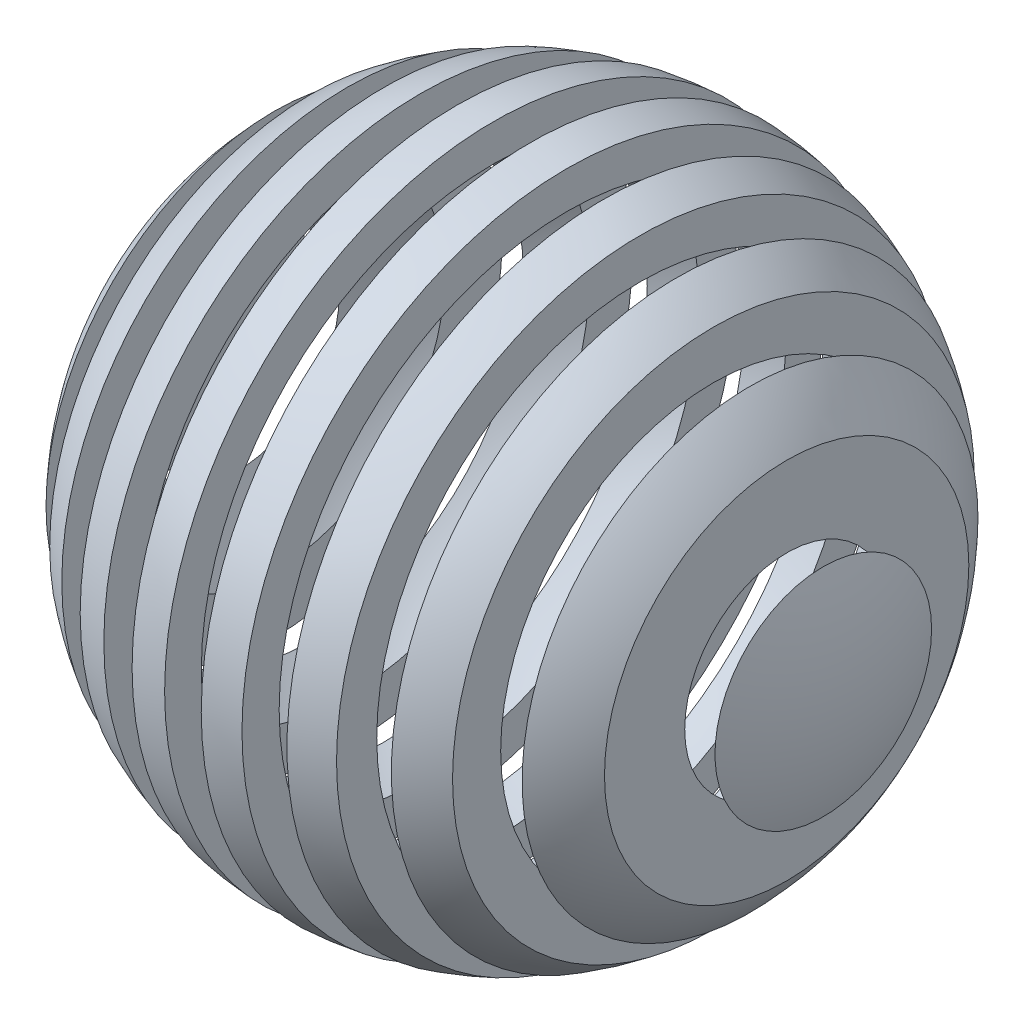
ISO-10303-21;
HEADER;
FILE_DESCRIPTION(('STEP AP214'),'2;1');
FILE_NAME('part.step','',(''),(''),'','','');
FILE_SCHEMA(('AUTOMOTIVE_DESIGN { 1 0 10303 214 1 1 1 1 }'));
ENDSEC;
DATA;
#1=APPLICATION_CONTEXT('core data for automotive mechanical design processes');
#2=APPLICATION_PROTOCOL_DEFINITION('international standard','automotive_design',2000,#1);
#3=PRODUCT_CONTEXT('',#1,'mechanical');
#4=PRODUCT('Part','Part','',(#3));
#5=PRODUCT_RELATED_PRODUCT_CATEGORY('part','',(#4));
#6=PRODUCT_DEFINITION_FORMATION('','',#4);
#7=PRODUCT_DEFINITION_CONTEXT('part definition',#1,'design');
#8=PRODUCT_DEFINITION('design','',#6,#7);
#9=PRODUCT_DEFINITION_SHAPE('','',#8);
#10=(LENGTH_UNIT() NAMED_UNIT(*) SI_UNIT(.MILLI.,.METRE.));
#11=(NAMED_UNIT(*) PLANE_ANGLE_UNIT() SI_UNIT($,.RADIAN.));
#12=(NAMED_UNIT(*) SI_UNIT($,.STERADIAN.) SOLID_ANGLE_UNIT());
#13=UNCERTAINTY_MEASURE_WITH_UNIT(LENGTH_MEASURE(1.E-05),#10,'distance_accuracy_value','');
#14=(GEOMETRIC_REPRESENTATION_CONTEXT(3) GLOBAL_UNCERTAINTY_ASSIGNED_CONTEXT((#13)) GLOBAL_UNIT_ASSIGNED_CONTEXT((#10,
#11,#12)) REPRESENTATION_CONTEXT('',''));
#15=CARTESIAN_POINT('',(0.,0.,0.));
#16=DIRECTION('',(0.,0.,1.));
#17=DIRECTION('',(1.,0.,0.));
#18=AXIS2_PLACEMENT_3D('',#15,#16,#17);
#19=CARTESIAN_POINT('',(0.,0.,0.));
#20=DIRECTION('',(-1.,0.,0.));
#21=DIRECTION('',(0.,1.,0.));
#22=AXIS2_PLACEMENT_3D('',#19,#20,#21);
#23=SPHERICAL_SURFACE('',#22,450.);
#24=CARTESIAN_POINT('',(-375.,0.,0.));
#25=DIRECTION('',(1.,0.,0.));
#26=DIRECTION('',(0.,0.,-1.));
#27=AXIS2_PLACEMENT_3D('',#24,#25,#26);
#28=CIRCLE('',#27,248.746859276655);
#29=CARTESIAN_POINT('',(-375.,0.,-248.746859276655));
#30=VERTEX_POINT('',#29);
#31=EDGE_CURVE('E56',#30,#30,#28,.T.);
#32=ORIENTED_EDGE('',*,*,#31,.T.);
#33=EDGE_LOOP('',(#32));
#34=FACE_BOUND('',#33,.T.);
#35=CARTESIAN_POINT('',(-325.,0.,0.));
#36=DIRECTION('',(-1.,0.,0.));
#37=DIRECTION('',(0.,0.,1.));
#38=AXIS2_PLACEMENT_3D('',#35,#36,#37);
#39=CIRCLE('',#38,311.247489949718);
#40=CARTESIAN_POINT('',(-325.,0.,311.247489949718));
#41=VERTEX_POINT('',#40);
#42=EDGE_CURVE('E64',#41,#41,#39,.T.);
#43=ORIENTED_EDGE('',*,*,#42,.T.);
#44=EDGE_LOOP('',(#43));
#45=FACE_BOUND('',#44,.T.);
#46=ADVANCED_FACE('F53',(#34,#45),#23,.T.);
#47=CARTESIAN_POINT('',(-325.,-488.145150409962,-449.305018890286));
#48=DIRECTION('',(-1.,0.,0.));
#49=DIRECTION('',(0.,0.,1.));
#50=AXIS2_PLACEMENT_3D('',#47,#48,#49);
#51=PLANE('',#50);
#52=ORIENTED_EDGE('',*,*,#42,.F.);
#53=EDGE_LOOP('',(#52));
#54=FACE_BOUND('',#53,.T.);
#55=CARTESIAN_POINT('',(-325.,0.,0.));
#56=DIRECTION('',(-1.,0.,0.));
#57=DIRECTION('',(0.,0.,1.));
#58=AXIS2_PLACEMENT_3D('',#55,#56,#57);
#59=CIRCLE('',#58,233.18447632722);
#60=CARTESIAN_POINT('',(-325.,0.,233.18447632722));
#61=VERTEX_POINT('',#60);
#62=EDGE_CURVE('E11',#61,#61,#59,.F.);
#63=ORIENTED_EDGE('',*,*,#62,.F.);
#64=EDGE_LOOP('',(#63));
#65=FACE_BOUND('',#64,.T.);
#66=ADVANCED_FACE('F81',(#54,#65),#51,.F.);
#67=CARTESIAN_POINT('',(0.,0.,0.));
#68=DIRECTION('',(-1.,0.,0.));
#69=DIRECTION('',(0.,1.,0.));
#70=AXIS2_PLACEMENT_3D('',#67,#68,#69);
#71=SPHERICAL_SURFACE('',#70,400.);
#72=CARTESIAN_POINT('',(-375.,0.,0.));
#73=DIRECTION('',(1.,0.,0.));
#74=DIRECTION('',(0.,0.,-1.));
#75=AXIS2_PLACEMENT_3D('',#72,#73,#74);
#76=CIRCLE('',#75,139.194109070751);
#77=CARTESIAN_POINT('',(-375.,0.,-139.194109070751));
#78=VERTEX_POINT('',#77);
#79=EDGE_CURVE('E60',#78,#78,#76,.F.);
#80=ORIENTED_EDGE('',*,*,#79,.T.);
#81=EDGE_LOOP('',(#80));
#82=FACE_BOUND('',#81,.T.);
#83=ORIENTED_EDGE('',*,*,#62,.T.);
#84=EDGE_LOOP('',(#83));
#85=FACE_BOUND('',#84,.T.);
#86=ADVANCED_FACE('F76',(#82,#85),#71,.F.);
#87=CARTESIAN_POINT('',(-375.,-488.145150409962,-449.305018890286));
#88=DIRECTION('',(1.,0.,0.));
#89=DIRECTION('',(0.,0.,-1.));
#90=AXIS2_PLACEMENT_3D('',#87,#88,#89);
#91=PLANE('',#90);
#92=ORIENTED_EDGE('',*,*,#79,.F.);
#93=EDGE_LOOP('',(#92));
#94=FACE_BOUND('',#93,.T.);
#95=ORIENTED_EDGE('',*,*,#31,.F.);
#96=EDGE_LOOP('',(#95));
#97=FACE_BOUND('',#96,.T.);
#98=ADVANCED_FACE('F74',(#94,#97),#91,.F.);
#99=CLOSED_SHELL('',(#46,#66,#86,#98));
#100=MANIFOLD_SOLID_BREP('B2',#99);
#101=CARTESIAN_POINT('',(0.,0.,0.));
#102=DIRECTION('',(-1.,0.,0.));
#103=DIRECTION('',(0.,1.,0.));
#104=AXIS2_PLACEMENT_3D('',#101,#102,#103);
#105=SPHERICAL_SURFACE('',#104,400.);
#106=CARTESIAN_POINT('',(-275.,0.,0.));
#107=DIRECTION('',(1.,0.,0.));
#108=DIRECTION('',(0.,0.,-1.));
#109=AXIS2_PLACEMENT_3D('',#106,#107,#108);
#110=CIRCLE('',#109,290.473750965556);
#111=CARTESIAN_POINT('',(-275.,0.,-290.473750965556));
#112=VERTEX_POINT('',#111);
#113=EDGE_CURVE('E125',#112,#112,#110,.F.);
#114=ORIENTED_EDGE('',*,*,#113,.T.);
#115=EDGE_LOOP('',(#114));
#116=FACE_BOUND('',#115,.T.);
#117=CARTESIAN_POINT('',(-225.,0.,0.));
#118=DIRECTION('',(-1.,0.,0.));
#119=DIRECTION('',(0.,0.,1.));
#120=AXIS2_PLACEMENT_3D('',#117,#118,#119);
#121=CIRCLE('',#120,330.718913883074);
#122=CARTESIAN_POINT('',(-225.,0.,330.718913883074));
#123=VERTEX_POINT('',#122);
#124=EDGE_CURVE('E135',#123,#123,#121,.F.);
#125=ORIENTED_EDGE('',*,*,#124,.T.);
#126=EDGE_LOOP('',(#125));
#127=FACE_BOUND('',#126,.T.);
#128=ADVANCED_FACE('F122',(#116,#127),#105,.F.);
#129=CARTESIAN_POINT('',(0.,0.,0.));
#130=DIRECTION('',(-1.,0.,0.));
#131=DIRECTION('',(0.,1.,0.));
#132=AXIS2_PLACEMENT_3D('',#129,#130,#131);
#133=SPHERICAL_SURFACE('',#132,450.);
#134=CARTESIAN_POINT('',(-275.,0.,0.));
#135=DIRECTION('',(1.,0.,0.));
#136=DIRECTION('',(0.,0.,-1.));
#137=AXIS2_PLACEMENT_3D('',#134,#135,#136);
#138=CIRCLE('',#137,356.195171219375);
#139=CARTESIAN_POINT('',(-275.,0.,-356.195171219375));
#140=VERTEX_POINT('',#139);
#141=EDGE_CURVE('E130',#140,#140,#138,.T.);
#142=ORIENTED_EDGE('',*,*,#141,.T.);
#143=EDGE_LOOP('',(#142));
#144=FACE_BOUND('',#143,.T.);
#145=CARTESIAN_POINT('',(-225.,0.,0.));
#146=DIRECTION('',(-1.,0.,0.));
#147=DIRECTION('',(0.,0.,1.));
#148=AXIS2_PLACEMENT_3D('',#145,#146,#147);
#149=CIRCLE('',#148,389.711431702997);
#150=CARTESIAN_POINT('',(-225.,0.,389.711431702997));
#151=VERTEX_POINT('',#150);
#152=EDGE_CURVE('E52',#151,#151,#149,.T.);
#153=ORIENTED_EDGE('',*,*,#152,.T.);
#154=EDGE_LOOP('',(#153));
#155=FACE_BOUND('',#154,.T.);
#156=ADVANCED_FACE('F155',(#144,#155),#133,.T.);
#157=CARTESIAN_POINT('',(-225.,-488.145150409962,-449.305018890286));
#158=DIRECTION('',(-1.,0.,0.));
#159=DIRECTION('',(0.,0.,1.));
#160=AXIS2_PLACEMENT_3D('',#157,#158,#159);
#161=PLANE('',#160);
#162=ORIENTED_EDGE('',*,*,#124,.F.);
#163=EDGE_LOOP('',(#162));
#164=FACE_BOUND('',#163,.T.);
#165=ORIENTED_EDGE('',*,*,#152,.F.);
#166=EDGE_LOOP('',(#165));
#167=FACE_BOUND('',#166,.T.);
#168=ADVANCED_FACE('F149',(#164,#167),#161,.F.);
#169=CARTESIAN_POINT('',(-275.,-488.145150409962,-449.305018890286));
#170=DIRECTION('',(1.,0.,0.));
#171=DIRECTION('',(0.,0.,-1.));
#172=AXIS2_PLACEMENT_3D('',#169,#170,#171);
#173=PLANE('',#172);
#174=ORIENTED_EDGE('',*,*,#141,.F.);
#175=EDGE_LOOP('',(#174));
#176=FACE_BOUND('',#175,.T.);
#177=ORIENTED_EDGE('',*,*,#113,.F.);
#178=EDGE_LOOP('',(#177));
#179=FACE_BOUND('',#178,.T.);
#180=ADVANCED_FACE('F147',(#176,#179),#173,.F.);
#181=CLOSED_SHELL('',(#128,#156,#168,#180));
#182=MANIFOLD_SOLID_BREP('B6',#181);
#183=CARTESIAN_POINT('',(0.,0.,0.));
#184=DIRECTION('',(-1.,0.,0.));
#185=DIRECTION('',(0.,1.,0.));
#186=AXIS2_PLACEMENT_3D('',#183,#184,#185);
#187=SPHERICAL_SURFACE('',#186,450.);
#188=CARTESIAN_POINT('',(-175.,0.,0.));
#189=DIRECTION('',(1.,0.,0.));
#190=DIRECTION('',(0.,0.,-1.));
#191=AXIS2_PLACEMENT_3D('',#188,#189,#190);
#192=CIRCLE('',#191,414.578098794425);
#193=CARTESIAN_POINT('',(-175.,0.,-414.578098794425));
#194=VERTEX_POINT('',#193);
#195=EDGE_CURVE('E198',#194,#194,#192,.T.);
#196=ORIENTED_EDGE('',*,*,#195,.T.);
#197=EDGE_LOOP('',(#196));
#198=FACE_BOUND('',#197,.T.);
#199=CARTESIAN_POINT('',(-125.,0.,0.));
#200=DIRECTION('',(-1.,0.,0.));
#201=DIRECTION('',(0.,0.,1.));
#202=AXIS2_PLACEMENT_3D('',#199,#200,#201);
#203=CIRCLE('',#202,432.290411644765);
#204=CARTESIAN_POINT('',(-125.,0.,432.290411644765));
#205=VERTEX_POINT('',#204);
#206=EDGE_CURVE('E206',#205,#205,#203,.T.);
#207=ORIENTED_EDGE('',*,*,#206,.T.);
#208=EDGE_LOOP('',(#207));
#209=FACE_BOUND('',#208,.T.);
#210=ADVANCED_FACE('F195',(#198,#209),#187,.T.);
#211=CARTESIAN_POINT('',(0.,0.,0.));
#212=DIRECTION('',(-1.,0.,0.));
#213=DIRECTION('',(0.,1.,0.));
#214=AXIS2_PLACEMENT_3D('',#211,#212,#213);
#215=SPHERICAL_SURFACE('',#214,400.);
#216=CARTESIAN_POINT('',(-175.,0.,0.));
#217=DIRECTION('',(1.,0.,0.));
#218=DIRECTION('',(0.,0.,-1.));
#219=AXIS2_PLACEMENT_3D('',#216,#217,#218);
#220=CIRCLE('',#219,359.687364248454);
#221=CARTESIAN_POINT('',(-175.,0.,-359.687364248454));
#222=VERTEX_POINT('',#221);
#223=EDGE_CURVE('E202',#222,#222,#220,.F.);
#224=ORIENTED_EDGE('',*,*,#223,.T.);
#225=EDGE_LOOP('',(#224));
#226=FACE_BOUND('',#225,.T.);
#227=CARTESIAN_POINT('',(-125.,0.,0.));
#228=DIRECTION('',(-1.,0.,0.));
#229=DIRECTION('',(0.,0.,1.));
#230=AXIS2_PLACEMENT_3D('',#227,#228,#229);
#231=CIRCLE('',#230,379.967103839267);
#232=CARTESIAN_POINT('',(-125.,0.,379.967103839267));
#233=VERTEX_POINT('',#232);
#234=EDGE_CURVE('E121',#233,#233,#231,.F.);
#235=ORIENTED_EDGE('',*,*,#234,.T.);
#236=EDGE_LOOP('',(#235));
#237=FACE_BOUND('',#236,.T.);
#238=ADVANCED_FACE('F224',(#226,#237),#215,.F.);
#239=CARTESIAN_POINT('',(-125.,-488.145150409962,-449.305018890286));
#240=DIRECTION('',(-1.,0.,0.));
#241=DIRECTION('',(0.,0.,1.));
#242=AXIS2_PLACEMENT_3D('',#239,#240,#241);
#243=PLANE('',#242);
#244=ORIENTED_EDGE('',*,*,#206,.F.);
#245=EDGE_LOOP('',(#244));
#246=FACE_BOUND('',#245,.T.);
#247=ORIENTED_EDGE('',*,*,#234,.F.);
#248=EDGE_LOOP('',(#247));
#249=FACE_BOUND('',#248,.T.);
#250=ADVANCED_FACE('F218',(#246,#249),#243,.F.);
#251=CARTESIAN_POINT('',(-175.,-488.145150409962,-449.305018890286));
#252=DIRECTION('',(1.,0.,0.));
#253=DIRECTION('',(0.,0.,-1.));
#254=AXIS2_PLACEMENT_3D('',#251,#252,#253);
#255=PLANE('',#254);
#256=ORIENTED_EDGE('',*,*,#223,.F.);
#257=EDGE_LOOP('',(#256));
#258=FACE_BOUND('',#257,.T.);
#259=ORIENTED_EDGE('',*,*,#195,.F.);
#260=EDGE_LOOP('',(#259));
#261=FACE_BOUND('',#260,.T.);
#262=ADVANCED_FACE('F216',(#258,#261),#255,.F.);
#263=CLOSED_SHELL('',(#210,#238,#250,#262));
#264=MANIFOLD_SOLID_BREP('B47',#263);
#265=CARTESIAN_POINT('',(0.,0.,0.));
#266=DIRECTION('',(-1.,0.,0.));
#267=DIRECTION('',(0.,1.,0.));
#268=AXIS2_PLACEMENT_3D('',#265,#266,#267);
#269=SPHERICAL_SURFACE('',#268,400.);
#270=CARTESIAN_POINT('',(-75.,0.,0.));
#271=DIRECTION('',(1.,0.,0.));
#272=DIRECTION('',(0.,0.,-1.));
#273=AXIS2_PLACEMENT_3D('',#270,#271,#272);
#274=CIRCLE('',#273,392.905841137543);
#275=CARTESIAN_POINT('',(-75.,0.,-392.905841137543));
#276=VERTEX_POINT('',#275);
#277=EDGE_CURVE('E267',#276,#276,#274,.F.);
#278=ORIENTED_EDGE('',*,*,#277,.T.);
#279=EDGE_LOOP('',(#278));
#280=FACE_BOUND('',#279,.T.);
#281=CARTESIAN_POINT('',(-25.,0.,0.));
#282=DIRECTION('',(-1.,0.,0.));
#283=DIRECTION('',(0.,0.,1.));
#284=AXIS2_PLACEMENT_3D('',#281,#282,#283);
#285=CIRCLE('',#284,399.217985566783);
#286=CARTESIAN_POINT('',(-25.,0.,399.217985566783));
#287=VERTEX_POINT('',#286);
#288=EDGE_CURVE('E275',#287,#287,#285,.F.);
#289=ORIENTED_EDGE('',*,*,#288,.T.);
#290=EDGE_LOOP('',(#289));
#291=FACE_BOUND('',#290,.T.);
#292=ADVANCED_FACE('F264',(#280,#291),#269,.F.);
#293=CARTESIAN_POINT('',(0.,0.,0.));
#294=DIRECTION('',(-1.,0.,0.));
#295=DIRECTION('',(0.,1.,0.));
#296=AXIS2_PLACEMENT_3D('',#293,#294,#295);
#297=SPHERICAL_SURFACE('',#296,450.);
#298=CARTESIAN_POINT('',(-75.,0.,0.));
#299=DIRECTION('',(1.,0.,0.));
#300=DIRECTION('',(0.,0.,-1.));
#301=AXIS2_PLACEMENT_3D('',#298,#299,#300);
#302=CIRCLE('',#301,443.705983732471);
#303=CARTESIAN_POINT('',(-75.,0.,-443.705983732471));
#304=VERTEX_POINT('',#303);
#305=EDGE_CURVE('E271',#304,#304,#302,.T.);
#306=ORIENTED_EDGE('',*,*,#305,.T.);
#307=EDGE_LOOP('',(#306));
#308=FACE_BOUND('',#307,.T.);
#309=CARTESIAN_POINT('',(-25.,0.,0.));
#310=DIRECTION('',(-1.,0.,0.));
#311=DIRECTION('',(0.,0.,1.));
#312=AXIS2_PLACEMENT_3D('',#309,#310,#311);
#313=CIRCLE('',#312,449.305018890286);
#314=CARTESIAN_POINT('',(-25.,0.,449.305018890286));
#315=VERTEX_POINT('',#314);
#316=EDGE_CURVE('E194',#315,#315,#313,.T.);
#317=ORIENTED_EDGE('',*,*,#316,.T.);
#318=EDGE_LOOP('',(#317));
#319=FACE_BOUND('',#318,.T.);
#320=ADVANCED_FACE('F293',(#308,#319),#297,.T.);
#321=CARTESIAN_POINT('',(-25.,-488.145150409962,-450.));
#322=DIRECTION('',(-1.,0.,0.));
#323=DIRECTION('',(0.,0.,1.));
#324=AXIS2_PLACEMENT_3D('',#321,#322,#323);
#325=PLANE('',#324);
#326=ORIENTED_EDGE('',*,*,#288,.F.);
#327=EDGE_LOOP('',(#326));
#328=FACE_BOUND('',#327,.T.);
#329=ORIENTED_EDGE('',*,*,#316,.F.);
#330=EDGE_LOOP('',(#329));
#331=FACE_BOUND('',#330,.T.);
#332=ADVANCED_FACE('F287',(#328,#331),#325,.F.);
#333=CARTESIAN_POINT('',(-75.,-488.145150409962,-449.305018890286));
#334=DIRECTION('',(1.,0.,0.));
#335=DIRECTION('',(0.,0.,-1.));
#336=AXIS2_PLACEMENT_3D('',#333,#334,#335);
#337=PLANE('',#336);
#338=ORIENTED_EDGE('',*,*,#305,.F.);
#339=EDGE_LOOP('',(#338));
#340=FACE_BOUND('',#339,.T.);
#341=ORIENTED_EDGE('',*,*,#277,.F.);
#342=EDGE_LOOP('',(#341));
#343=FACE_BOUND('',#342,.T.);
#344=ADVANCED_FACE('F285',(#340,#343),#337,.F.);
#345=CLOSED_SHELL('',(#292,#320,#332,#344));
#346=MANIFOLD_SOLID_BREP('B116',#345);
#347=CARTESIAN_POINT('',(0.,0.,0.));
#348=DIRECTION('',(-1.,0.,0.));
#349=DIRECTION('',(0.,1.,0.));
#350=AXIS2_PLACEMENT_3D('',#347,#348,#349);
#351=SPHERICAL_SURFACE('',#350,450.);
#352=CARTESIAN_POINT('',(375.,0.,0.));
#353=DIRECTION('',(-1.,0.,0.));
#354=DIRECTION('',(0.,0.,1.));
#355=AXIS2_PLACEMENT_3D('',#352,#353,#354);
#356=CIRCLE('',#355,248.746859276655);
#357=CARTESIAN_POINT('',(375.,0.,248.746859276655));
#358=VERTEX_POINT('',#357);
#359=EDGE_CURVE('E336',#358,#358,#356,.T.);
#360=ORIENTED_EDGE('',*,*,#359,.T.);
#361=EDGE_LOOP('',(#360));
#362=FACE_BOUND('',#361,.T.);
#363=CARTESIAN_POINT('',(325.,0.,0.));
#364=DIRECTION('',(1.,0.,0.));
#365=DIRECTION('',(0.,0.,-1.));
#366=AXIS2_PLACEMENT_3D('',#363,#364,#365);
#367=CIRCLE('',#366,311.247489949718);
#368=CARTESIAN_POINT('',(325.,0.,-311.247489949718));
#369=VERTEX_POINT('',#368);
#370=EDGE_CURVE('E344',#369,#369,#367,.T.);
#371=ORIENTED_EDGE('',*,*,#370,.T.);
#372=EDGE_LOOP('',(#371));
#373=FACE_BOUND('',#372,.T.);
#374=ADVANCED_FACE('F333',(#362,#373),#351,.T.);
#375=CARTESIAN_POINT('',(325.,-488.145150409962,-449.305018890286));
#376=DIRECTION('',(1.,0.,0.));
#377=DIRECTION('',(0.,0.,-1.));
#378=AXIS2_PLACEMENT_3D('',#375,#376,#377);
#379=PLANE('',#378);
#380=ORIENTED_EDGE('',*,*,#370,.F.);
#381=EDGE_LOOP('',(#380));
#382=FACE_BOUND('',#381,.T.);
#383=CARTESIAN_POINT('',(325.,0.,0.));
#384=DIRECTION('',(1.,0.,0.));
#385=DIRECTION('',(0.,0.,-1.));
#386=AXIS2_PLACEMENT_3D('',#383,#384,#385);
#387=CIRCLE('',#386,233.18447632722);
#388=CARTESIAN_POINT('',(325.,0.,-233.18447632722));
#389=VERTEX_POINT('',#388);
#390=EDGE_CURVE('E263',#389,#389,#387,.F.);
#391=ORIENTED_EDGE('',*,*,#390,.F.);
#392=EDGE_LOOP('',(#391));
#393=FACE_BOUND('',#392,.T.);
#394=ADVANCED_FACE('F361',(#382,#393),#379,.F.);
#395=CARTESIAN_POINT('',(0.,0.,0.));
#396=DIRECTION('',(-1.,0.,0.));
#397=DIRECTION('',(0.,1.,0.));
#398=AXIS2_PLACEMENT_3D('',#395,#396,#397);
#399=SPHERICAL_SURFACE('',#398,400.);
#400=CARTESIAN_POINT('',(375.,0.,0.));
#401=DIRECTION('',(-1.,0.,0.));
#402=DIRECTION('',(0.,0.,1.));
#403=AXIS2_PLACEMENT_3D('',#400,#401,#402);
#404=CIRCLE('',#403,139.194109070751);
#405=CARTESIAN_POINT('',(375.,0.,139.194109070751));
#406=VERTEX_POINT('',#405);
#407=EDGE_CURVE('E340',#406,#406,#404,.F.);
#408=ORIENTED_EDGE('',*,*,#407,.T.);
#409=EDGE_LOOP('',(#408));
#410=FACE_BOUND('',#409,.T.);
#411=ORIENTED_EDGE('',*,*,#390,.T.);
#412=EDGE_LOOP('',(#411));
#413=FACE_BOUND('',#412,.T.);
#414=ADVANCED_FACE('F356',(#410,#413),#399,.F.);
#415=CARTESIAN_POINT('',(375.,-488.145150409962,-449.305018890286));
#416=DIRECTION('',(-1.,0.,0.));
#417=DIRECTION('',(0.,0.,1.));
#418=AXIS2_PLACEMENT_3D('',#415,#416,#417);
#419=PLANE('',#418);
#420=ORIENTED_EDGE('',*,*,#407,.F.);
#421=EDGE_LOOP('',(#420));
#422=FACE_BOUND('',#421,.T.);
#423=ORIENTED_EDGE('',*,*,#359,.F.);
#424=EDGE_LOOP('',(#423));
#425=FACE_BOUND('',#424,.T.);
#426=ADVANCED_FACE('F354',(#422,#425),#419,.F.);
#427=CLOSED_SHELL('',(#374,#394,#414,#426));
#428=MANIFOLD_SOLID_BREP('B189',#427);
#429=CARTESIAN_POINT('',(0.,0.,0.));
#430=DIRECTION('',(-1.,0.,0.));
#431=DIRECTION('',(0.,1.,0.));
#432=AXIS2_PLACEMENT_3D('',#429,#430,#431);
#433=SPHERICAL_SURFACE('',#432,400.);
#434=CARTESIAN_POINT('',(275.,0.,0.));
#435=DIRECTION('',(-1.,0.,0.));
#436=DIRECTION('',(0.,0.,1.));
#437=AXIS2_PLACEMENT_3D('',#434,#435,#436);
#438=CIRCLE('',#437,290.473750965556);
#439=CARTESIAN_POINT('',(275.,0.,290.473750965556));
#440=VERTEX_POINT('',#439);
#441=EDGE_CURVE('E405',#440,#440,#438,.F.);
#442=ORIENTED_EDGE('',*,*,#441,.T.);
#443=EDGE_LOOP('',(#442));
#444=FACE_BOUND('',#443,.T.);
#445=CARTESIAN_POINT('',(225.,0.,0.));
#446=DIRECTION('',(1.,0.,0.));
#447=DIRECTION('',(0.,0.,-1.));
#448=AXIS2_PLACEMENT_3D('',#445,#446,#447);
#449=CIRCLE('',#448,330.718913883074);
#450=CARTESIAN_POINT('',(225.,0.,-330.718913883074));
#451=VERTEX_POINT('',#450);
#452=EDGE_CURVE('E413',#451,#451,#449,.F.);
#453=ORIENTED_EDGE('',*,*,#452,.T.);
#454=EDGE_LOOP('',(#453));
#455=FACE_BOUND('',#454,.T.);
#456=ADVANCED_FACE('F402',(#444,#455),#433,.F.);
#457=CARTESIAN_POINT('',(225.,-488.145150409962,-449.305018890286));
#458=DIRECTION('',(1.,0.,0.));
#459=DIRECTION('',(0.,0.,-1.));
#460=AXIS2_PLACEMENT_3D('',#457,#458,#459);
#461=PLANE('',#460);
#462=ORIENTED_EDGE('',*,*,#452,.F.);
#463=EDGE_LOOP('',(#462));
#464=FACE_BOUND('',#463,.T.);
#465=CARTESIAN_POINT('',(225.,0.,0.));
#466=DIRECTION('',(1.,0.,0.));
#467=DIRECTION('',(0.,0.,-1.));
#468=AXIS2_PLACEMENT_3D('',#465,#466,#467);
#469=CIRCLE('',#468,389.711431702997);
#470=CARTESIAN_POINT('',(225.,0.,-389.711431702997));
#471=VERTEX_POINT('',#470);
#472=EDGE_CURVE('E332',#471,#471,#469,.T.);
#473=ORIENTED_EDGE('',*,*,#472,.F.);
#474=EDGE_LOOP('',(#473));
#475=FACE_BOUND('',#474,.T.);
#476=ADVANCED_FACE('F431',(#464,#475),#461,.F.);
#477=CARTESIAN_POINT('',(0.,0.,0.));
#478=DIRECTION('',(-1.,0.,0.));
#479=DIRECTION('',(0.,1.,0.));
#480=AXIS2_PLACEMENT_3D('',#477,#478,#479);
#481=SPHERICAL_SURFACE('',#480,450.);
#482=CARTESIAN_POINT('',(275.,0.,0.));
#483=DIRECTION('',(-1.,0.,0.));
#484=DIRECTION('',(0.,0.,1.));
#485=AXIS2_PLACEMENT_3D('',#482,#483,#484);
#486=CIRCLE('',#485,356.195171219375);
#487=CARTESIAN_POINT('',(275.,0.,356.195171219375));
#488=VERTEX_POINT('',#487);
#489=EDGE_CURVE('E409',#488,#488,#486,.T.);
#490=ORIENTED_EDGE('',*,*,#489,.T.);
#491=EDGE_LOOP('',(#490));
#492=FACE_BOUND('',#491,.T.);
#493=ORIENTED_EDGE('',*,*,#472,.T.);
#494=EDGE_LOOP('',(#493));
#495=FACE_BOUND('',#494,.T.);
#496=ADVANCED_FACE('F425',(#492,#495),#481,.T.);
#497=CARTESIAN_POINT('',(275.,-488.145150409962,-449.305018890286));
#498=DIRECTION('',(-1.,0.,0.));
#499=DIRECTION('',(0.,0.,1.));
#500=AXIS2_PLACEMENT_3D('',#497,#498,#499);
#501=PLANE('',#500);
#502=ORIENTED_EDGE('',*,*,#489,.F.);
#503=EDGE_LOOP('',(#502));
#504=FACE_BOUND('',#503,.T.);
#505=ORIENTED_EDGE('',*,*,#441,.F.);
#506=EDGE_LOOP('',(#505));
#507=FACE_BOUND('',#506,.T.);
#508=ADVANCED_FACE('F423',(#504,#507),#501,.F.);
#509=CLOSED_SHELL('',(#456,#476,#496,#508));
#510=MANIFOLD_SOLID_BREP('B258',#509);
#511=CARTESIAN_POINT('',(0.,0.,0.));
#512=DIRECTION('',(-1.,0.,0.));
#513=DIRECTION('',(0.,1.,0.));
#514=AXIS2_PLACEMENT_3D('',#511,#512,#513);
#515=SPHERICAL_SURFACE('',#514,450.);
#516=CARTESIAN_POINT('',(175.,0.,0.));
#517=DIRECTION('',(-1.,0.,0.));
#518=DIRECTION('',(0.,0.,1.));
#519=AXIS2_PLACEMENT_3D('',#516,#517,#518);
#520=CIRCLE('',#519,414.578098794425);
#521=CARTESIAN_POINT('',(175.,0.,414.578098794425));
#522=VERTEX_POINT('',#521);
#523=EDGE_CURVE('E474',#522,#522,#520,.T.);
#524=ORIENTED_EDGE('',*,*,#523,.T.);
#525=EDGE_LOOP('',(#524));
#526=FACE_BOUND('',#525,.T.);
#527=CARTESIAN_POINT('',(125.,0.,0.));
#528=DIRECTION('',(1.,0.,0.));
#529=DIRECTION('',(0.,0.,-1.));
#530=AXIS2_PLACEMENT_3D('',#527,#528,#529);
#531=CIRCLE('',#530,432.290411644765);
#532=CARTESIAN_POINT('',(125.,0.,-432.290411644765));
#533=VERTEX_POINT('',#532);
#534=EDGE_CURVE('E482',#533,#533,#531,.T.);
#535=ORIENTED_EDGE('',*,*,#534,.T.);
#536=EDGE_LOOP('',(#535));
#537=FACE_BOUND('',#536,.T.);
#538=ADVANCED_FACE('F471',(#526,#537),#515,.T.);
#539=CARTESIAN_POINT('',(125.,-488.145150409962,-449.305018890286));
#540=DIRECTION('',(1.,0.,0.));
#541=DIRECTION('',(0.,0.,-1.));
#542=AXIS2_PLACEMENT_3D('',#539,#540,#541);
#543=PLANE('',#542);
#544=ORIENTED_EDGE('',*,*,#534,.F.);
#545=EDGE_LOOP('',(#544));
#546=FACE_BOUND('',#545,.T.);
#547=CARTESIAN_POINT('',(125.,0.,0.));
#548=DIRECTION('',(1.,0.,0.));
#549=DIRECTION('',(0.,0.,-1.));
#550=AXIS2_PLACEMENT_3D('',#547,#548,#549);
#551=CIRCLE('',#550,379.967103839267);
#552=CARTESIAN_POINT('',(125.,0.,-379.967103839267));
#553=VERTEX_POINT('',#552);
#554=EDGE_CURVE('E401',#553,#553,#551,.F.);
#555=ORIENTED_EDGE('',*,*,#554,.F.);
#556=EDGE_LOOP('',(#555));
#557=FACE_BOUND('',#556,.T.);
#558=ADVANCED_FACE('F500',(#546,#557),#543,.F.);
#559=CARTESIAN_POINT('',(0.,0.,0.));
#560=DIRECTION('',(-1.,0.,0.));
#561=DIRECTION('',(0.,1.,0.));
#562=AXIS2_PLACEMENT_3D('',#559,#560,#561);
#563=SPHERICAL_SURFACE('',#562,400.);
#564=CARTESIAN_POINT('',(175.,0.,0.));
#565=DIRECTION('',(-1.,0.,0.));
#566=DIRECTION('',(0.,0.,1.));
#567=AXIS2_PLACEMENT_3D('',#564,#565,#566);
#568=CIRCLE('',#567,359.687364248454);
#569=CARTESIAN_POINT('',(175.,0.,359.687364248454));
#570=VERTEX_POINT('',#569);
#571=EDGE_CURVE('E478',#570,#570,#568,.F.);
#572=ORIENTED_EDGE('',*,*,#571,.T.);
#573=EDGE_LOOP('',(#572));
#574=FACE_BOUND('',#573,.T.);
#575=ORIENTED_EDGE('',*,*,#554,.T.);
#576=EDGE_LOOP('',(#575));
#577=FACE_BOUND('',#576,.T.);
#578=ADVANCED_FACE('F494',(#574,#577),#563,.F.);
#579=CARTESIAN_POINT('',(175.,-488.145150409962,-449.305018890286));
#580=DIRECTION('',(-1.,0.,0.));
#581=DIRECTION('',(0.,0.,1.));
#582=AXIS2_PLACEMENT_3D('',#579,#580,#581);
#583=PLANE('',#582);
#584=ORIENTED_EDGE('',*,*,#571,.F.);
#585=EDGE_LOOP('',(#584));
#586=FACE_BOUND('',#585,.T.);
#587=ORIENTED_EDGE('',*,*,#523,.F.);
#588=EDGE_LOOP('',(#587));
#589=FACE_BOUND('',#588,.T.);
#590=ADVANCED_FACE('F492',(#586,#589),#583,.F.);
#591=CLOSED_SHELL('',(#538,#558,#578,#590));
#592=MANIFOLD_SOLID_BREP('B327',#591);
#593=CARTESIAN_POINT('',(0.,0.,0.));
#594=DIRECTION('',(-1.,0.,0.));
#595=DIRECTION('',(0.,1.,0.));
#596=AXIS2_PLACEMENT_3D('',#593,#594,#595);
#597=SPHERICAL_SURFACE('',#596,400.);
#598=CARTESIAN_POINT('',(75.,0.,0.));
#599=DIRECTION('',(-1.,0.,0.));
#600=DIRECTION('',(0.,0.,1.));
#601=AXIS2_PLACEMENT_3D('',#598,#599,#600);
#602=CIRCLE('',#601,392.905841137543);
#603=CARTESIAN_POINT('',(75.,0.,392.905841137543));
#604=VERTEX_POINT('',#603);
#605=EDGE_CURVE('E543',#604,#604,#602,.F.);
#606=ORIENTED_EDGE('',*,*,#605,.T.);
#607=EDGE_LOOP('',(#606));
#608=FACE_BOUND('',#607,.T.);
#609=CARTESIAN_POINT('',(25.,0.,0.));
#610=DIRECTION('',(1.,0.,0.));
#611=DIRECTION('',(0.,0.,-1.));
#612=AXIS2_PLACEMENT_3D('',#609,#610,#611);
#613=CIRCLE('',#612,399.217985566783);
#614=CARTESIAN_POINT('',(25.,0.,-399.217985566783));
#615=VERTEX_POINT('',#614);
#616=EDGE_CURVE('E552',#615,#615,#613,.F.);
#617=ORIENTED_EDGE('',*,*,#616,.T.);
#618=EDGE_LOOP('',(#617));
#619=FACE_BOUND('',#618,.T.);
#620=ADVANCED_FACE('F540',(#608,#619),#597,.F.);
#621=CARTESIAN_POINT('',(25.,-488.145150409962,-450.));
#622=DIRECTION('',(1.,0.,0.));
#623=DIRECTION('',(0.,0.,-1.));
#624=AXIS2_PLACEMENT_3D('',#621,#622,#623);
#625=PLANE('',#624);
#626=ORIENTED_EDGE('',*,*,#616,.F.);
#627=EDGE_LOOP('',(#626));
#628=FACE_BOUND('',#627,.T.);
#629=CARTESIAN_POINT('',(25.,0.,0.));
#630=DIRECTION('',(1.,0.,0.));
#631=DIRECTION('',(0.,0.,-1.));
#632=AXIS2_PLACEMENT_3D('',#629,#630,#631);
#633=CIRCLE('',#632,449.305018890286);
#634=CARTESIAN_POINT('',(25.,0.,-449.305018890286));
#635=VERTEX_POINT('',#634);
#636=EDGE_CURVE('E470',#635,#635,#633,.T.);
#637=ORIENTED_EDGE('',*,*,#636,.F.);
#638=EDGE_LOOP('',(#637));
#639=FACE_BOUND('',#638,.T.);
#640=ADVANCED_FACE('F569',(#628,#639),#625,.F.);
#641=CARTESIAN_POINT('',(0.,0.,0.));
#642=DIRECTION('',(-1.,0.,0.));
#643=DIRECTION('',(0.,1.,0.));
#644=AXIS2_PLACEMENT_3D('',#641,#642,#643);
#645=SPHERICAL_SURFACE('',#644,450.);
#646=CARTESIAN_POINT('',(75.,0.,0.));
#647=DIRECTION('',(-1.,0.,0.));
#648=DIRECTION('',(0.,0.,1.));
#649=AXIS2_PLACEMENT_3D('',#646,#647,#648);
#650=CIRCLE('',#649,443.705983732471);
#651=CARTESIAN_POINT('',(75.,0.,443.705983732471));
#652=VERTEX_POINT('',#651);
#653=EDGE_CURVE('E547',#652,#652,#650,.T.);
#654=ORIENTED_EDGE('',*,*,#653,.T.);
#655=EDGE_LOOP('',(#654));
#656=FACE_BOUND('',#655,.T.);
#657=ORIENTED_EDGE('',*,*,#636,.T.);
#658=EDGE_LOOP('',(#657));
#659=FACE_BOUND('',#658,.T.);
#660=ADVANCED_FACE('F563',(#656,#659),#645,.T.);
#661=CARTESIAN_POINT('',(75.,-488.145150409962,-449.305018890286));
#662=DIRECTION('',(-1.,0.,0.));
#663=DIRECTION('',(0.,0.,1.));
#664=AXIS2_PLACEMENT_3D('',#661,#662,#663);
#665=PLANE('',#664);
#666=ORIENTED_EDGE('',*,*,#653,.F.);
#667=EDGE_LOOP('',(#666));
#668=FACE_BOUND('',#667,.T.);
#669=ORIENTED_EDGE('',*,*,#605,.F.);
#670=EDGE_LOOP('',(#669));
#671=FACE_BOUND('',#670,.T.);
#672=ADVANCED_FACE('F561',(#668,#671),#665,.F.);
#673=CLOSED_SHELL('',(#620,#640,#660,#672));
#674=MANIFOLD_SOLID_BREP('B396',#673);
#675=CARTESIAN_POINT('',(0.,0.,0.));
#676=DIRECTION('',(-1.,0.,0.));
#677=DIRECTION('',(0.,1.,0.));
#678=AXIS2_PLACEMENT_3D('',#675,#676,#677);
#679=SPHERICAL_SURFACE('',#678,450.);
#680=CARTESIAN_POINT('',(425.,0.,0.));
#681=DIRECTION('',(1.,0.,0.));
#682=DIRECTION('',(0.,0.,-1.));
#683=AXIS2_PLACEMENT_3D('',#680,#681,#682);
#684=CIRCLE('',#683,147.90199457749);
#685=CARTESIAN_POINT('',(425.,0.,-147.90199457749));
#686=VERTEX_POINT('',#685);
#687=EDGE_CURVE('E539',#686,#686,#684,.T.);
#688=ORIENTED_EDGE('',*,*,#687,.T.);
#689=EDGE_LOOP('',(#688));
#690=FACE_BOUND('',#689,.T.);
#691=ADVANCED_FACE('F608',(#690),#679,.T.);
#692=CARTESIAN_POINT('',(425.,-488.145150409962,-449.305018890286));
#693=DIRECTION('',(1.,0.,0.));
#694=DIRECTION('',(0.,0.,-1.));
#695=AXIS2_PLACEMENT_3D('',#692,#693,#694);
#696=PLANE('',#695);
#697=ORIENTED_EDGE('',*,*,#687,.F.);
#698=EDGE_LOOP('',(#697));
#699=FACE_BOUND('',#698,.T.);
#700=ADVANCED_FACE('F616',(#699),#696,.F.);
#701=CLOSED_SHELL('',(#691,#700));
#702=MANIFOLD_SOLID_BREP('B465',#701);
#703=CARTESIAN_POINT('',(0.,0.,0.));
#704=DIRECTION('',(-1.,0.,0.));
#705=DIRECTION('',(0.,1.,0.));
#706=AXIS2_PLACEMENT_3D('',#703,#704,#705);
#707=SPHERICAL_SURFACE('',#706,450.);
#708=CARTESIAN_POINT('',(-425.,0.,0.));
#709=DIRECTION('',(-1.,0.,0.));
#710=DIRECTION('',(0.,0.,1.));
#711=AXIS2_PLACEMENT_3D('',#708,#709,#710);
#712=CIRCLE('',#711,147.901994577491);
#713=CARTESIAN_POINT('',(-425.,0.,147.901994577491));
#714=VERTEX_POINT('',#713);
#715=EDGE_CURVE('E607',#714,#714,#712,.T.);
#716=ORIENTED_EDGE('',*,*,#715,.T.);
#717=EDGE_LOOP('',(#716));
#718=FACE_BOUND('',#717,.T.);
#719=ADVANCED_FACE('F633',(#718),#707,.T.);
#720=CARTESIAN_POINT('',(-425.,-488.145150409962,-449.305018890286));
#721=DIRECTION('',(-1.,0.,0.));
#722=DIRECTION('',(0.,0.,1.));
#723=AXIS2_PLACEMENT_3D('',#720,#721,#722);
#724=PLANE('',#723);
#725=ORIENTED_EDGE('',*,*,#715,.F.);
#726=EDGE_LOOP('',(#725));
#727=FACE_BOUND('',#726,.T.);
#728=ADVANCED_FACE('F641',(#727),#724,.F.);
#729=CLOSED_SHELL('',(#719,#728));
#730=MANIFOLD_SOLID_BREP('B534',#729);
#731=ADVANCED_BREP_SHAPE_REPRESENTATION('',(#18,#100,#182,#264,#346,#428,#510,#592,#674,#702,
#730),#14);
#732=SHAPE_DEFINITION_REPRESENTATION(#9,#731);
ENDSEC;
END-ISO-10303-21;
